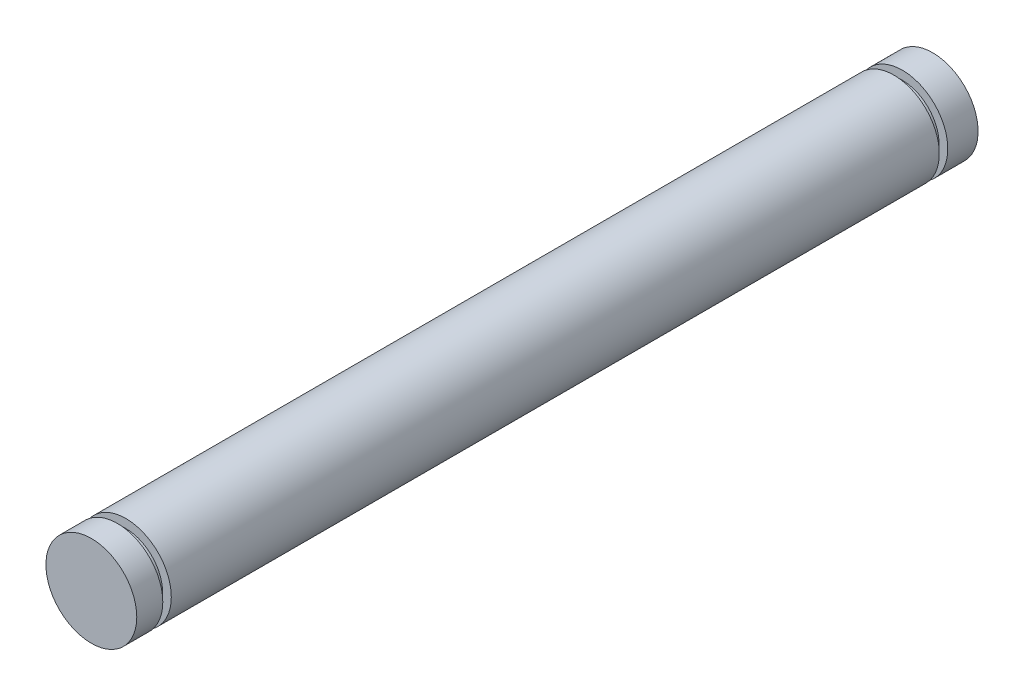
ISO-10303-21;
HEADER;
FILE_DESCRIPTION(('STEP AP214'),'2;1');
FILE_NAME('part.step','',(''),(''),'','','');
FILE_SCHEMA(('AUTOMOTIVE_DESIGN { 1 0 10303 214 1 1 1 1 }'));
ENDSEC;
DATA;
#1=APPLICATION_CONTEXT('core data for automotive mechanical design processes');
#2=APPLICATION_PROTOCOL_DEFINITION('international standard','automotive_design',2000,#1);
#3=PRODUCT_CONTEXT('',#1,'mechanical');
#4=PRODUCT('Part','Part','',(#3));
#5=PRODUCT_RELATED_PRODUCT_CATEGORY('part','',(#4));
#6=PRODUCT_DEFINITION_FORMATION('','',#4);
#7=PRODUCT_DEFINITION_CONTEXT('part definition',#1,'design');
#8=PRODUCT_DEFINITION('design','',#6,#7);
#9=PRODUCT_DEFINITION_SHAPE('','',#8);
#10=(LENGTH_UNIT() NAMED_UNIT(*) SI_UNIT(.MILLI.,.METRE.));
#11=(NAMED_UNIT(*) PLANE_ANGLE_UNIT() SI_UNIT($,.RADIAN.));
#12=(NAMED_UNIT(*) SI_UNIT($,.STERADIAN.) SOLID_ANGLE_UNIT());
#13=UNCERTAINTY_MEASURE_WITH_UNIT(LENGTH_MEASURE(1.E-05),#10,'distance_accuracy_value','');
#14=(GEOMETRIC_REPRESENTATION_CONTEXT(3) GLOBAL_UNCERTAINTY_ASSIGNED_CONTEXT((#13)) GLOBAL_UNIT_ASSIGNED_CONTEXT((#10,
#11,#12)) REPRESENTATION_CONTEXT('',''));
#15=CARTESIAN_POINT('',(0.,0.,0.));
#16=DIRECTION('',(0.,0.,1.));
#17=DIRECTION('',(1.,0.,0.));
#18=AXIS2_PLACEMENT_3D('',#15,#16,#17);
#19=CARTESIAN_POINT('',(0.,0.,97.3074));
#20=DIRECTION('',(0.,0.,-1.));
#21=DIRECTION('',(-1.,0.,0.));
#22=AXIS2_PLACEMENT_3D('',#19,#20,#21);
#23=CYLINDRICAL_SURFACE('',#22,4.7625);
#24=CARTESIAN_POINT('',(0.,0.,6.7691));
#25=DIRECTION('',(0.,0.,-1.));
#26=DIRECTION('',(-1.,0.,0.));
#27=AXIS2_PLACEMENT_3D('',#24,#25,#26);
#28=CIRCLE('',#27,4.7625);
#29=CARTESIAN_POINT('',(-4.7625,0.,6.7691));
#30=VERTEX_POINT('',#29);
#31=EDGE_CURVE('E40',#30,#30,#28,.T.);
#32=ORIENTED_EDGE('',*,*,#31,.T.);
#33=EDGE_LOOP('',(#32));
#34=FACE_BOUND('',#33,.T.);
#35=CARTESIAN_POINT('',(0.,0.,3.5941));
#36=DIRECTION('',(0.,0.,-1.));
#37=DIRECTION('',(-1.,0.,0.));
#38=AXIS2_PLACEMENT_3D('',#35,#36,#37);
#39=CIRCLE('',#38,4.7625);
#40=CARTESIAN_POINT('',(-4.7625,0.,3.5941));
#41=VERTEX_POINT('',#40);
#42=EDGE_CURVE('E36',#41,#41,#39,.T.);
#43=ORIENTED_EDGE('',*,*,#42,.F.);
#44=EDGE_LOOP('',(#43));
#45=FACE_BOUND('',#44,.T.);
#46=ADVANCED_FACE('F33',(#34,#45),#23,.T.);
#47=CARTESIAN_POINT('',(0.,0.,89.0651));
#48=DIRECTION('',(0.,0.,1.));
#49=DIRECTION('',(1.,0.,0.));
#50=AXIS2_PLACEMENT_3D('',#47,#48,#49);
#51=CIRCLE('',#50,4.7625);
#52=CARTESIAN_POINT('',(4.7625,0.,89.0651));
#53=VERTEX_POINT('',#52);
#54=EDGE_CURVE('E49',#53,#53,#51,.T.);
#55=ORIENTED_EDGE('',*,*,#54,.T.);
#56=EDGE_LOOP('',(#55));
#57=FACE_BOUND('',#56,.T.);
#58=CARTESIAN_POINT('',(0.,0.,91.7956));
#59=DIRECTION('',(0.,0.,1.));
#60=DIRECTION('',(1.,0.,0.));
#61=AXIS2_PLACEMENT_3D('',#58,#59,#60);
#62=CIRCLE('',#61,4.7625);
#63=CARTESIAN_POINT('',(4.7625,0.,91.7956));
#64=VERTEX_POINT('',#63);
#65=EDGE_CURVE('E56',#64,#64,#62,.T.);
#66=ORIENTED_EDGE('',*,*,#65,.F.);
#67=EDGE_LOOP('',(#66));
#68=FACE_BOUND('',#67,.T.);
#69=ADVANCED_FACE('F69',(#57,#68),#23,.T.);
#70=CARTESIAN_POINT('',(0.,0.,7.6581));
#71=DIRECTION('',(0.,0.,-1.));
#72=DIRECTION('',(-1.,0.,0.));
#73=AXIS2_PLACEMENT_3D('',#70,#71,#72);
#74=CIRCLE('',#73,4.7625);
#75=CARTESIAN_POINT('',(-4.7625,0.,7.6581));
#76=VERTEX_POINT('',#75);
#77=EDGE_CURVE('E12',#76,#76,#74,.T.);
#78=ORIENTED_EDGE('',*,*,#77,.F.);
#79=EDGE_LOOP('',(#78));
#80=FACE_BOUND('',#79,.T.);
#81=CARTESIAN_POINT('',(0.,0.,88.1761));
#82=DIRECTION('',(0.,0.,1.));
#83=DIRECTION('',(1.,0.,0.));
#84=AXIS2_PLACEMENT_3D('',#81,#82,#83);
#85=CIRCLE('',#84,4.7625);
#86=CARTESIAN_POINT('',(4.7625,0.,88.1761));
#87=VERTEX_POINT('',#86);
#88=EDGE_CURVE('E52',#87,#87,#85,.T.);
#89=ORIENTED_EDGE('',*,*,#88,.F.);
#90=EDGE_LOOP('',(#89));
#91=FACE_BOUND('',#90,.T.);
#92=ADVANCED_FACE('F71',(#80,#91),#23,.T.);
#93=CARTESIAN_POINT('',(0.,0.,7.6581));
#94=DIRECTION('',(0.,0.,-1.));
#95=DIRECTION('',(-1.,0.,0.));
#96=AXIS2_PLACEMENT_3D('',#93,#94,#95);
#97=PLANE('',#96);
#98=CARTESIAN_POINT('',(0.,0.,7.6581));
#99=DIRECTION('',(0.,0.,-1.));
#100=DIRECTION('',(-1.,0.,0.));
#101=AXIS2_PLACEMENT_3D('',#98,#99,#100);
#102=CIRCLE('',#101,3.8481);
#103=CARTESIAN_POINT('',(-3.8481,0.,7.6581));
#104=VERTEX_POINT('',#103);
#105=EDGE_CURVE('E45',#104,#104,#102,.T.);
#106=ORIENTED_EDGE('',*,*,#105,.F.);
#107=EDGE_LOOP('',(#106));
#108=FACE_BOUND('',#107,.T.);
#109=ORIENTED_EDGE('',*,*,#77,.T.);
#110=EDGE_LOOP('',(#109));
#111=FACE_BOUND('',#110,.T.);
#112=ADVANCED_FACE('F77',(#108,#111),#97,.T.);
#113=CARTESIAN_POINT('',(0.,0.,6.7691));
#114=DIRECTION('',(0.,0.,-1.));
#115=DIRECTION('',(-1.,0.,0.));
#116=AXIS2_PLACEMENT_3D('',#113,#114,#115);
#117=PLANE('',#116);
#118=CARTESIAN_POINT('',(0.,0.,6.7691));
#119=DIRECTION('',(0.,0.,-1.));
#120=DIRECTION('',(-1.,0.,0.));
#121=AXIS2_PLACEMENT_3D('',#118,#119,#120);
#122=CIRCLE('',#121,3.8481);
#123=CARTESIAN_POINT('',(-3.8481,0.,6.7691));
#124=VERTEX_POINT('',#123);
#125=EDGE_CURVE('E55',#124,#124,#122,.T.);
#126=ORIENTED_EDGE('',*,*,#125,.T.);
#127=EDGE_LOOP('',(#126));
#128=FACE_BOUND('',#127,.T.);
#129=ORIENTED_EDGE('',*,*,#31,.F.);
#130=EDGE_LOOP('',(#129));
#131=FACE_BOUND('',#130,.T.);
#132=ADVANCED_FACE('F82',(#128,#131),#117,.F.);
#133=CARTESIAN_POINT('',(0.,0.,7.6581));
#134=DIRECTION('',(0.,0.,-1.));
#135=DIRECTION('',(-1.,0.,0.));
#136=AXIS2_PLACEMENT_3D('',#133,#134,#135);
#137=CYLINDRICAL_SURFACE('',#136,3.8481);
#138=ORIENTED_EDGE('',*,*,#105,.T.);
#139=EDGE_LOOP('',(#138));
#140=FACE_BOUND('',#139,.T.);
#141=ORIENTED_EDGE('',*,*,#125,.F.);
#142=EDGE_LOOP('',(#141));
#143=FACE_BOUND('',#142,.T.);
#144=ADVANCED_FACE('F91',(#140,#143),#137,.T.);
#145=CARTESIAN_POINT('',(0.,0.,88.1761));
#146=DIRECTION('',(0.,0.,1.));
#147=DIRECTION('',(1.,0.,0.));
#148=AXIS2_PLACEMENT_3D('',#145,#146,#147);
#149=PLANE('',#148);
#150=CARTESIAN_POINT('',(0.,0.,88.1761));
#151=DIRECTION('',(0.,0.,1.));
#152=DIRECTION('',(1.,0.,0.));
#153=AXIS2_PLACEMENT_3D('',#150,#151,#152);
#154=CIRCLE('',#153,3.8481);
#155=CARTESIAN_POINT('',(3.8481,0.,88.1761));
#156=VERTEX_POINT('',#155);
#157=EDGE_CURVE('E53',#156,#156,#154,.T.);
#158=ORIENTED_EDGE('',*,*,#157,.F.);
#159=EDGE_LOOP('',(#158));
#160=FACE_BOUND('',#159,.T.);
#161=ORIENTED_EDGE('',*,*,#88,.T.);
#162=EDGE_LOOP('',(#161));
#163=FACE_BOUND('',#162,.T.);
#164=ADVANCED_FACE('F88',(#160,#163),#149,.T.);
#165=CARTESIAN_POINT('',(0.,0.,89.0651));
#166=DIRECTION('',(0.,0.,1.));
#167=DIRECTION('',(1.,0.,0.));
#168=AXIS2_PLACEMENT_3D('',#165,#166,#167);
#169=PLANE('',#168);
#170=CARTESIAN_POINT('',(0.,0.,89.0651));
#171=DIRECTION('',(0.,0.,1.));
#172=DIRECTION('',(1.,0.,0.));
#173=AXIS2_PLACEMENT_3D('',#170,#171,#172);
#174=CIRCLE('',#173,3.8481);
#175=CARTESIAN_POINT('',(3.8481,0.,89.0651));
#176=VERTEX_POINT('',#175);
#177=EDGE_CURVE('E58',#176,#176,#174,.T.);
#178=ORIENTED_EDGE('',*,*,#177,.T.);
#179=EDGE_LOOP('',(#178));
#180=FACE_BOUND('',#179,.T.);
#181=ORIENTED_EDGE('',*,*,#54,.F.);
#182=EDGE_LOOP('',(#181));
#183=FACE_BOUND('',#182,.T.);
#184=ADVANCED_FACE('F90',(#180,#183),#169,.F.);
#185=CARTESIAN_POINT('',(0.,0.,88.1761));
#186=DIRECTION('',(0.,0.,1.));
#187=DIRECTION('',(1.,0.,0.));
#188=AXIS2_PLACEMENT_3D('',#185,#186,#187);
#189=CYLINDRICAL_SURFACE('',#188,3.8481);
#190=ORIENTED_EDGE('',*,*,#157,.T.);
#191=EDGE_LOOP('',(#190));
#192=FACE_BOUND('',#191,.T.);
#193=ORIENTED_EDGE('',*,*,#177,.F.);
#194=EDGE_LOOP('',(#193));
#195=FACE_BOUND('',#194,.T.);
#196=ADVANCED_FACE('F98',(#192,#195),#189,.T.);
#197=CARTESIAN_POINT('',(0.,0.,91.7956));
#198=DIRECTION('',(0.,0.,1.));
#199=DIRECTION('',(1.,0.,0.));
#200=AXIS2_PLACEMENT_3D('',#197,#198,#199);
#201=PLANE('',#200);
#202=ORIENTED_EDGE('',*,*,#65,.T.);
#203=EDGE_LOOP('',(#202));
#204=FACE_BOUND('',#203,.T.);
#205=ADVANCED_FACE('F122',(#204),#201,.T.);
#206=CARTESIAN_POINT('',(0.,0.,3.5941));
#207=DIRECTION('',(0.,0.,-1.));
#208=DIRECTION('',(-1.,0.,0.));
#209=AXIS2_PLACEMENT_3D('',#206,#207,#208);
#210=PLANE('',#209);
#211=ORIENTED_EDGE('',*,*,#42,.T.);
#212=EDGE_LOOP('',(#211));
#213=FACE_BOUND('',#212,.T.);
#214=ADVANCED_FACE('F66',(#213),#210,.T.);
#215=CLOSED_SHELL('',(#46,#69,#92,#112,#132,#144,#164,#184,#196,#205,#214));
#216=MANIFOLD_SOLID_BREP('B2',#215);
#217=ADVANCED_BREP_SHAPE_REPRESENTATION('',(#18,#216),#14);
#218=SHAPE_DEFINITION_REPRESENTATION(#9,#217);
ENDSEC;
END-ISO-10303-21;
